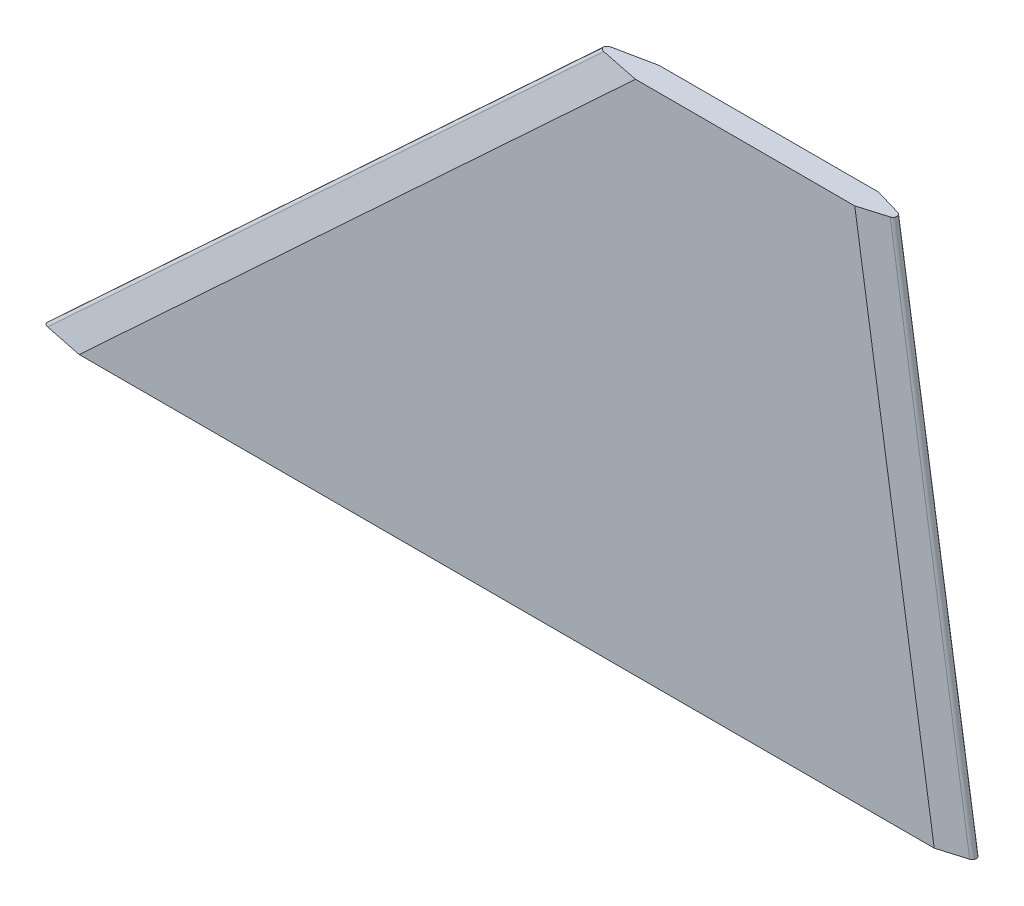
ISO-10303-21;
HEADER;
FILE_DESCRIPTION(('STEP AP214'),'2;1');
FILE_NAME('part.step','',(''),(''),'','','');
FILE_SCHEMA(('AUTOMOTIVE_DESIGN { 1 0 10303 214 1 1 1 1 }'));
ENDSEC;
DATA;
#1=APPLICATION_CONTEXT('core data for automotive mechanical design processes');
#2=APPLICATION_PROTOCOL_DEFINITION('international standard','automotive_design',2000,#1);
#3=PRODUCT_CONTEXT('',#1,'mechanical');
#4=PRODUCT('Part','Part','',(#3));
#5=PRODUCT_RELATED_PRODUCT_CATEGORY('part','',(#4));
#6=PRODUCT_DEFINITION_FORMATION('','',#4);
#7=PRODUCT_DEFINITION_CONTEXT('part definition',#1,'design');
#8=PRODUCT_DEFINITION('design','',#6,#7);
#9=PRODUCT_DEFINITION_SHAPE('','',#8);
#10=(LENGTH_UNIT() NAMED_UNIT(*) SI_UNIT(.MILLI.,.METRE.));
#11=(NAMED_UNIT(*) PLANE_ANGLE_UNIT() SI_UNIT($,.RADIAN.));
#12=(NAMED_UNIT(*) SI_UNIT($,.STERADIAN.) SOLID_ANGLE_UNIT());
#13=UNCERTAINTY_MEASURE_WITH_UNIT(LENGTH_MEASURE(1.E-05),#10,'distance_accuracy_value','');
#14=(GEOMETRIC_REPRESENTATION_CONTEXT(3) GLOBAL_UNCERTAINTY_ASSIGNED_CONTEXT((#13)) GLOBAL_UNIT_ASSIGNED_CONTEXT((#10,
#11,#12)) REPRESENTATION_CONTEXT('',''));
#15=CARTESIAN_POINT('',(0.,0.,0.));
#16=DIRECTION('',(0.,0.,1.));
#17=DIRECTION('',(1.,0.,0.));
#18=AXIS2_PLACEMENT_3D('',#15,#16,#17);
#19=CARTESIAN_POINT('',(0.,0.,7.62));
#20=DIRECTION('',(0.,1.,0.));
#21=DIRECTION('',(0.,0.,1.));
#22=AXIS2_PLACEMENT_3D('',#19,#20,#21);
#23=PLANE('',#22);
#24=DIRECTION('',(0.958741892075678,0.,0.284278005443878));
#25=VECTOR('',#24,1.);
#26=CARTESIAN_POINT('',(281.45267520323,0.,-3.11275051349502));
#27=LINE('',#26,#25);
#28=CARTESIAN_POINT('',(291.950583095218,0.,0.));
#29=VERTEX_POINT('',#28);
#30=CARTESIAN_POINT('',(300.697496912945,0.,2.5935606177691));
#31=VERTEX_POINT('',#30);
#32=EDGE_CURVE('E197',#29,#31,#27,.T.);
#33=ORIENTED_EDGE('',*,*,#32,.T.);
#34=CARTESIAN_POINT('',(300.32827163511,0.,3.80999999999996));
#35=DIRECTION('',(0.,1.,0.));
#36=DIRECTION('',(1.,0.,0.));
#37=AXIS2_PLACEMENT_3D('',#34,#35,#36);
#38=ELLIPSE('',#37,1.28494169047821,1.27);
#39=CARTESIAN_POINT('',(300.697496912945,0.,5.02643938223083));
#40=VERTEX_POINT('',#39);
#41=EDGE_CURVE('E13',#31,#40,#38,.F.);
#42=ORIENTED_EDGE('',*,*,#41,.T.);
#43=DIRECTION('',(0.958741892075676,0.,-0.284278005443885));
#44=VECTOR('',#43,1.);
#45=CARTESIAN_POINT('',(285.74579943664,0.,9.45978976745495));
#46=LINE('',#45,#44);
#47=CARTESIAN_POINT('',(291.950583095218,0.,7.62));
#48=VERTEX_POINT('',#47);
#49=EDGE_CURVE('E151',#40,#48,#46,.F.);
#50=ORIENTED_EDGE('',*,*,#49,.T.);
#51=DIRECTION('',(1.,0.,0.));
#52=VECTOR('',#51,1.);
#53=CARTESIAN_POINT('',(0.,0.,7.62));
#54=LINE('',#53,#52);
#55=CARTESIAN_POINT('',(18.6640891782072,0.,7.62));
#56=VERTEX_POINT('',#55);
#57=EDGE_CURVE('E143',#56,#48,#54,.T.);
#58=ORIENTED_EDGE('',*,*,#57,.F.);
#59=DIRECTION('',(0.979793749622474,0.,0.200010520225144));
#60=VECTOR('',#59,1.);
#61=CARTESIAN_POINT('',(9.04266554671776,0.,5.65592751374236));
#62=LINE('',#61,#60);
#63=CARTESIAN_POINT('',(5.9589850681997,0.,5.02643938223084));
#64=VERTEX_POINT('',#63);
#65=EDGE_CURVE('E126',#56,#64,#62,.F.);
#66=ORIENTED_EDGE('',*,*,#65,.T.);
#67=CARTESIAN_POINT('',(6.49529372433766,0.,3.80999999999998));
#68=DIRECTION('',(0.,1.,0.));
#69=DIRECTION('',(1.,0.,0.));
#70=AXIS2_PLACEMENT_3D('',#67,#68,#69);
#71=ELLIPSE('',#70,1.86640891782072,1.27);
#72=CARTESIAN_POINT('',(5.95898506819976,0.,2.59356061776911));
#73=VERTEX_POINT('',#72);
#74=EDGE_CURVE('E179',#64,#73,#71,.F.);
#75=ORIENTED_EDGE('',*,*,#74,.T.);
#76=DIRECTION('',(0.979793749622475,0.,-0.200010520225138));
#77=VECTOR('',#76,1.);
#78=CARTESIAN_POINT('',(0.,0.,3.81000000000001));
#79=LINE('',#78,#77);
#80=CARTESIAN_POINT('',(18.6640891782075,0.,0.));
#81=VERTEX_POINT('',#80);
#82=EDGE_CURVE('E137',#73,#81,#79,.T.);
#83=ORIENTED_EDGE('',*,*,#82,.T.);
#84=DIRECTION('',(1.,0.,0.));
#85=VECTOR('',#84,1.);
#86=CARTESIAN_POINT('',(0.,0.,0.));
#87=LINE('',#86,#85);
#88=EDGE_CURVE('E159',#81,#29,#87,.T.);
#89=ORIENTED_EDGE('',*,*,#88,.T.);
#90=EDGE_LOOP('',(#33,#42,#50,#58,#66,#75,#83,#89));
#91=FACE_BOUND('',#90,.T.);
#92=ADVANCED_FACE('F60',(#91),#23,.F.);
#93=CARTESIAN_POINT('',(177.8,165.1,7.62));
#94=DIRECTION('',(0.,-1.,0.));
#95=DIRECTION('',(0.,0.,-1.));
#96=AXIS2_PLACEMENT_3D('',#93,#94,#95);
#97=PLANE('',#96);
#98=DIRECTION('',(-0.958741892075676,0.,0.284278005443885));
#99=VECTOR('',#98,1.);
#100=CARTESIAN_POINT('',(283.69312423341,165.1,2.53703925395979));
#101=LINE('',#100,#99);
#102=CARTESIAN_POINT('',(266.550583095218,165.1,7.62));
#103=VERTEX_POINT('',#102);
#104=CARTESIAN_POINT('',(275.297496912945,165.1,5.02643938223083));
#105=VERTEX_POINT('',#104);
#106=EDGE_CURVE('E194',#103,#105,#101,.F.);
#107=ORIENTED_EDGE('',*,*,#106,.T.);
#108=CARTESIAN_POINT('',(274.92827163511,165.1,3.80999999999996));
#109=DIRECTION('',(0.,-1.,0.));
#110=DIRECTION('',(1.,0.,0.));
#111=AXIS2_PLACEMENT_3D('',#108,#109,#110);
#112=ELLIPSE('',#111,1.28494169047821,1.27);
#113=CARTESIAN_POINT('',(275.297496912945,165.1,2.59356061776909));
#114=VERTEX_POINT('',#113);
#115=EDGE_CURVE('E83',#105,#114,#112,.F.);
#116=ORIENTED_EDGE('',*,*,#115,.T.);
#117=DIRECTION('',(-0.958741892075678,0.,-0.284278005443878));
#118=VECTOR('',#117,1.);
#119=CARTESIAN_POINT('',(279.4,165.1,3.80999999999998));
#120=LINE('',#119,#118);
#121=CARTESIAN_POINT('',(266.550583095218,165.1,0.));
#122=VERTEX_POINT('',#121);
#123=EDGE_CURVE('E191',#114,#122,#120,.T.);
#124=ORIENTED_EDGE('',*,*,#123,.T.);
#125=DIRECTION('',(-1.,0.,0.));
#126=VECTOR('',#125,1.);
#127=CARTESIAN_POINT('',(177.8,165.1,0.));
#128=LINE('',#127,#126);
#129=CARTESIAN_POINT('',(196.464089178207,165.1,0.));
#130=VERTEX_POINT('',#129);
#131=EDGE_CURVE('E153',#122,#130,#128,.T.);
#132=ORIENTED_EDGE('',*,*,#131,.T.);
#133=DIRECTION('',(-0.979793749622475,0.,0.200010520225138));
#134=VECTOR('',#133,1.);
#135=CARTESIAN_POINT('',(7.11274821808983,165.1,38.6532984368936));
#136=LINE('',#135,#134);
#137=CARTESIAN_POINT('',(183.7589850682,165.1,2.59356061776911));
#138=VERTEX_POINT('',#137);
#139=EDGE_CURVE('E136',#130,#138,#136,.T.);
#140=ORIENTED_EDGE('',*,*,#139,.T.);
#141=CARTESIAN_POINT('',(184.295293724338,165.1,3.80999999999998));
#142=DIRECTION('',(0.,-1.,0.));
#143=DIRECTION('',(1.,0.,0.));
#144=AXIS2_PLACEMENT_3D('',#141,#142,#143);
#145=ELLIPSE('',#144,1.86640891782072,1.27);
#146=CARTESIAN_POINT('',(183.7589850682,165.1,5.02643938223085));
#147=VERTEX_POINT('',#146);
#148=EDGE_CURVE('E185',#138,#147,#145,.F.);
#149=ORIENTED_EDGE('',*,*,#148,.T.);
#150=DIRECTION('',(-0.979793749622474,0.,-0.200010520225144));
#151=VECTOR('',#150,1.);
#152=CARTESIAN_POINT('',(16.1554137648081,165.1,-29.1873709231524));
#153=LINE('',#152,#151);
#154=CARTESIAN_POINT('',(196.464089178207,165.1,7.62));
#155=VERTEX_POINT('',#154);
#156=EDGE_CURVE('E170',#147,#155,#153,.F.);
#157=ORIENTED_EDGE('',*,*,#156,.T.);
#158=DIRECTION('',(-1.,0.,0.));
#159=VECTOR('',#158,1.);
#160=CARTESIAN_POINT('',(177.8,165.1,7.62));
#161=LINE('',#160,#159);
#162=EDGE_CURVE('E146',#103,#155,#161,.T.);
#163=ORIENTED_EDGE('',*,*,#162,.F.);
#164=EDGE_LOOP('',(#107,#116,#124,#132,#140,#149,#157,#163));
#165=FACE_BOUND('',#164,.T.);
#166=ADVANCED_FACE('F237',(#165),#97,.F.);
#167=CARTESIAN_POINT('',(0.,0.,7.62));
#168=DIRECTION('',(0.,0.,-1.));
#169=DIRECTION('',(-1.,0.,0.));
#170=AXIS2_PLACEMENT_3D('',#167,#168,#169);
#171=PLANE('',#170);
#172=ORIENTED_EDGE('',*,*,#57,.T.);
#173=DIRECTION('',(-0.152057184253941,0.988371697650617,0.));
#174=VECTOR('',#173,1.);
#175=CARTESIAN_POINT('',(285.200280595906,43.8769662455241,7.62));
#176=LINE('',#175,#174);
#177=EDGE_CURVE('E188',#48,#103,#176,.T.);
#178=ORIENTED_EDGE('',*,*,#177,.T.);
#179=ORIENTED_EDGE('',*,*,#162,.T.);
#180=DIRECTION('',(-0.732793491626299,-0.680451099367278,0.));
#181=VECTOR('',#180,1.);
#182=CARTESIAN_POINT('',(8.64172896196444,-9.30647734365401,7.62));
#183=LINE('',#182,#181);
#184=EDGE_CURVE('E130',#155,#56,#183,.T.);
#185=ORIENTED_EDGE('',*,*,#184,.T.);
#186=EDGE_LOOP('',(#172,#178,#179,#185));
#187=FACE_BOUND('',#186,.T.);
#188=ADVANCED_FACE('F141',(#187),#171,.F.);
#189=CARTESIAN_POINT('',(0.,0.,0.));
#190=DIRECTION('',(0.,0.,-1.));
#191=DIRECTION('',(-1.,0.,0.));
#192=AXIS2_PLACEMENT_3D('',#189,#190,#191);
#193=PLANE('',#192);
#194=ORIENTED_EDGE('',*,*,#131,.F.);
#195=DIRECTION('',(0.152057184253941,-0.988371697650617,0.));
#196=VECTOR('',#195,1.);
#197=CARTESIAN_POINT('',(292.247679439837,-1.93112624002506,0.));
#198=LINE('',#197,#196);
#199=EDGE_CURVE('E202',#122,#29,#198,.T.);
#200=ORIENTED_EDGE('',*,*,#199,.T.);
#201=ORIENTED_EDGE('',*,*,#88,.F.);
#202=DIRECTION('',(0.732793491626299,0.680451099367278,0.));
#203=VECTOR('',#202,1.);
#204=CARTESIAN_POINT('',(186.441728961965,155.793522656346,0.));
#205=LINE('',#204,#203);
#206=EDGE_CURVE('E173',#81,#130,#205,.T.);
#207=ORIENTED_EDGE('',*,*,#206,.T.);
#208=EDGE_LOOP('',(#194,#200,#201,#207));
#209=FACE_BOUND('',#208,.T.);
#210=ADVANCED_FACE('F250',(#209),#193,.T.);
#211=CARTESIAN_POINT('',(0.,0.,3.81000000000001));
#212=DIRECTION('',(-0.19552618463448,0.210566660375594,-0.957826285221152));
#213=DIRECTION('',(0.732793491626299,0.680451099367278,0.));
#214=AXIS2_PLACEMENT_3D('',#211,#212,#213);
#215=PLANE('',#214);
#216=ORIENTED_EDGE('',*,*,#82,.F.);
#217=DIRECTION('',(0.732793491626299,0.680451099367278,0.));
#218=VECTOR('',#217,1.);
#219=CARTESIAN_POINT('',(2.75909171650893,-2.97132954085577,2.59356061776911));
#220=LINE('',#219,#218);
#221=EDGE_CURVE('E182',#73,#138,#220,.T.);
#222=ORIENTED_EDGE('',*,*,#221,.T.);
#223=ORIENTED_EDGE('',*,*,#139,.F.);
#224=ORIENTED_EDGE('',*,*,#206,.F.);
#225=EDGE_LOOP('',(#216,#222,#223,#224));
#226=FACE_BOUND('',#225,.T.);
#227=ADVANCED_FACE('F246',(#226),#215,.T.);
#228=CARTESIAN_POINT('',(8.64172896196444,-9.30647734365401,7.62));
#229=DIRECTION('',(0.195526184634487,-0.210566660375601,-0.95782628522115));
#230=DIRECTION('',(-0.732793491626299,-0.680451099367278,0.));
#231=AXIS2_PLACEMENT_3D('',#228,#229,#230);
#232=PLANE('',#231);
#233=ORIENTED_EDGE('',*,*,#156,.F.);
#234=DIRECTION('',(-0.732793491626299,-0.680451099367278,0.));
#235=VECTOR('',#234,1.);
#236=CARTESIAN_POINT('',(2.7590917165089,-2.97132954085574,5.02643938223084));
#237=LINE('',#236,#235);
#238=EDGE_CURVE('E132',#147,#64,#237,.T.);
#239=ORIENTED_EDGE('',*,*,#238,.T.);
#240=ORIENTED_EDGE('',*,*,#65,.F.);
#241=ORIENTED_EDGE('',*,*,#184,.F.);
#242=EDGE_LOOP('',(#233,#239,#240,#241));
#243=FACE_BOUND('',#242,.T.);
#244=ADVANCED_FACE('F129',(#243),#232,.F.);
#245=CARTESIAN_POINT('',(3.0074099709947,-3.23874919953275,3.80999999999998));
#246=DIRECTION('',(0.732793491626299,0.680451099367278,0.));
#247=DIRECTION('',(-0.680451099367278,0.732793491626299,0.));
#248=AXIS2_PLACEMENT_3D('',#245,#246,#247);
#249=CYLINDRICAL_SURFACE('',#248,1.27);
#250=ORIENTED_EDGE('',*,*,#148,.F.);
#251=ORIENTED_EDGE('',*,*,#221,.F.);
#252=ORIENTED_EDGE('',*,*,#74,.F.);
#253=ORIENTED_EDGE('',*,*,#238,.F.);
#254=EDGE_LOOP('',(#250,#251,#252,#253));
#255=FACE_BOUND('',#254,.T.);
#256=ADVANCED_FACE('F240',(#255),#249,.T.);
#257=CARTESIAN_POINT('',(279.4,165.1,3.80999999999998));
#258=DIRECTION('',(0.284006517473522,0.0436933103805418,-0.957826285221152));
#259=DIRECTION('',(0.152057184253941,-0.988371697650617,0.));
#260=AXIS2_PLACEMENT_3D('',#257,#258,#259);
#261=PLANE('',#260);
#262=ORIENTED_EDGE('',*,*,#123,.F.);
#263=DIRECTION('',(0.152057184253941,-0.988371697650617,0.));
#264=VECTOR('',#263,1.);
#265=CARTESIAN_POINT('',(275.392352475651,164.483438842408,2.5935606177691));
#266=LINE('',#265,#264);
#267=EDGE_CURVE('E69',#114,#31,#266,.T.);
#268=ORIENTED_EDGE('',*,*,#267,.T.);
#269=ORIENTED_EDGE('',*,*,#32,.F.);
#270=ORIENTED_EDGE('',*,*,#199,.F.);
#271=EDGE_LOOP('',(#262,#268,#269,#270));
#272=FACE_BOUND('',#271,.T.);
#273=ADVANCED_FACE('F252',(#272),#261,.T.);
#274=CARTESIAN_POINT('',(285.200280595906,43.8769662455241,7.62));
#275=DIRECTION('',(-0.284006517473529,-0.043693310380543,-0.95782628522115));
#276=DIRECTION('',(-0.152057184253941,0.988371697650617,0.));
#277=AXIS2_PLACEMENT_3D('',#274,#275,#276);
#278=PLANE('',#277);
#279=ORIENTED_EDGE('',*,*,#49,.F.);
#280=DIRECTION('',(-0.152057184253941,0.988371697650617,0.));
#281=VECTOR('',#280,1.);
#282=CARTESIAN_POINT('',(293.744953631721,45.1915313279571,5.02643938223083));
#283=LINE('',#282,#281);
#284=EDGE_CURVE('E205',#40,#105,#283,.T.);
#285=ORIENTED_EDGE('',*,*,#284,.T.);
#286=ORIENTED_EDGE('',*,*,#106,.F.);
#287=ORIENTED_EDGE('',*,*,#177,.F.);
#288=EDGE_LOOP('',(#279,#285,#286,#287));
#289=FACE_BOUND('',#288,.T.);
#290=ADVANCED_FACE('F234',(#289),#278,.F.);
#291=CARTESIAN_POINT('',(293.384265354529,45.1360408237738,3.80999999999996));
#292=DIRECTION('',(0.152057184253941,-0.988371697650617,0.));
#293=DIRECTION('',(0.988371697650617,0.152057184253941,0.));
#294=AXIS2_PLACEMENT_3D('',#291,#292,#293);
#295=CYLINDRICAL_SURFACE('',#294,1.27);
#296=ORIENTED_EDGE('',*,*,#41,.F.);
#297=ORIENTED_EDGE('',*,*,#267,.F.);
#298=ORIENTED_EDGE('',*,*,#115,.F.);
#299=ORIENTED_EDGE('',*,*,#284,.F.);
#300=EDGE_LOOP('',(#296,#297,#298,#299));
#301=FACE_BOUND('',#300,.T.);
#302=ADVANCED_FACE('F62',(#301),#295,.T.);
#303=CLOSED_SHELL('',(#92,#166,#188,#210,#227,#244,#256,#273,#290,#302));
#304=MANIFOLD_SOLID_BREP('B2',#303);
#305=ADVANCED_BREP_SHAPE_REPRESENTATION('',(#18,#304),#14);
#306=SHAPE_DEFINITION_REPRESENTATION(#9,#305);
ENDSEC;
END-ISO-10303-21;
